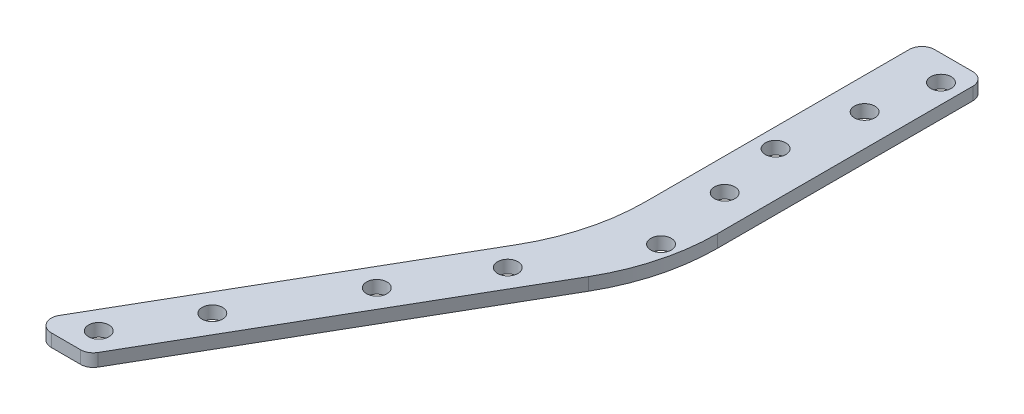
ISO-10303-21;
HEADER;
FILE_DESCRIPTION(('STEP AP214'),'2;1');
FILE_NAME('part.step','',(''),(''),'','','');
FILE_SCHEMA(('AUTOMOTIVE_DESIGN { 1 0 10303 214 1 1 1 1 }'));
ENDSEC;
DATA;
#1=APPLICATION_CONTEXT('core data for automotive mechanical design processes');
#2=APPLICATION_PROTOCOL_DEFINITION('international standard','automotive_design',2000,#1);
#3=PRODUCT_CONTEXT('',#1,'mechanical');
#4=PRODUCT('Part','Part','',(#3));
#5=PRODUCT_RELATED_PRODUCT_CATEGORY('part','',(#4));
#6=PRODUCT_DEFINITION_FORMATION('','',#4);
#7=PRODUCT_DEFINITION_CONTEXT('part definition',#1,'design');
#8=PRODUCT_DEFINITION('design','',#6,#7);
#9=PRODUCT_DEFINITION_SHAPE('','',#8);
#10=(LENGTH_UNIT() NAMED_UNIT(*) SI_UNIT(.MILLI.,.METRE.));
#11=(NAMED_UNIT(*) PLANE_ANGLE_UNIT() SI_UNIT($,.RADIAN.));
#12=(NAMED_UNIT(*) SI_UNIT($,.STERADIAN.) SOLID_ANGLE_UNIT());
#13=UNCERTAINTY_MEASURE_WITH_UNIT(LENGTH_MEASURE(1.E-05),#10,'distance_accuracy_value','');
#14=(GEOMETRIC_REPRESENTATION_CONTEXT(3) GLOBAL_UNCERTAINTY_ASSIGNED_CONTEXT((#13)) GLOBAL_UNIT_ASSIGNED_CONTEXT((#10,
#11,#12)) REPRESENTATION_CONTEXT('',''));
#15=CARTESIAN_POINT('',(0.,0.,0.));
#16=DIRECTION('',(0.,0.,1.));
#17=DIRECTION('',(1.,0.,0.));
#18=AXIS2_PLACEMENT_3D('',#15,#16,#17);
#19=CARTESIAN_POINT('',(0.,-3.175,0.));
#20=DIRECTION('',(0.,-1.,0.));
#21=DIRECTION('',(0.,0.,-1.));
#22=AXIS2_PLACEMENT_3D('',#19,#20,#21);
#23=PLANE('',#22);
#24=CARTESIAN_POINT('',(7.9375,-3.175,22.225));
#25=DIRECTION('',(0.,1.,0.));
#26=DIRECTION('',(0.,0.,1.));
#27=AXIS2_PLACEMENT_3D('',#24,#25,#26);
#28=CIRCLE('',#27,2.5527);
#29=CARTESIAN_POINT('',(7.9375,-3.175,24.7777));
#30=VERTEX_POINT('',#29);
#31=EDGE_CURVE('E437',#30,#30,#28,.T.);
#32=ORIENTED_EDGE('',*,*,#31,.T.);
#33=EDGE_LOOP('',(#32));
#34=FACE_BOUND('',#33,.T.);
#35=CARTESIAN_POINT('',(7.93750000000001,-3.175,57.15));
#36=DIRECTION('',(0.,1.,0.));
#37=DIRECTION('',(0.,0.,1.));
#38=AXIS2_PLACEMENT_3D('',#35,#36,#37);
#39=CIRCLE('',#38,2.5527);
#40=CARTESIAN_POINT('',(7.93750000000001,-3.175,59.7027));
#41=VERTEX_POINT('',#40);
#42=EDGE_CURVE('E429',#41,#41,#39,.T.);
#43=ORIENTED_EDGE('',*,*,#42,.T.);
#44=EDGE_LOOP('',(#43));
#45=FACE_BOUND('',#44,.T.);
#46=DIRECTION('',(0.,0.,-1.));
#47=VECTOR('',#46,1.);
#48=CARTESIAN_POINT('',(15.875,-3.175,0.));
#49=LINE('',#48,#47);
#50=CARTESIAN_POINT('',(15.875,-3.175,66.841874454343));
#51=VERTEX_POINT('',#50);
#52=CARTESIAN_POINT('',(15.875,-3.175,3.175));
#53=VERTEX_POINT('',#52);
#54=EDGE_CURVE('E223',#51,#53,#49,.T.);
#55=ORIENTED_EDGE('',*,*,#54,.F.);
#56=CARTESIAN_POINT('',(-34.925,-3.175,66.841874454343));
#57=DIRECTION('',(0.,-1.,0.));
#58=DIRECTION('',(0.,0.,-1.));
#59=AXIS2_PLACEMENT_3D('',#56,#57,#58);
#60=CIRCLE('',#59,50.8);
#61=CARTESIAN_POINT('',(9.06909051224946,-3.175,92.2418744543431));
#62=VERTEX_POINT('',#61);
#63=EDGE_CURVE('E202',#51,#62,#60,.T.);
#64=ORIENTED_EDGE('',*,*,#63,.T.);
#65=DIRECTION('',(0.500000000000001,0.,-0.866025403784438));
#66=VECTOR('',#65,1.);
#67=CARTESIAN_POINT('',(-36.6617420935413,-3.175,171.45));
#68=LINE('',#67,#66);
#69=CARTESIAN_POINT('',(-35.7451985412028,-3.175,169.8625));
#70=VERTEX_POINT('',#69);
#71=EDGE_CURVE('E267',#70,#62,#68,.T.);
#72=ORIENTED_EDGE('',*,*,#71,.F.);
#73=CARTESIAN_POINT('',(-38.4948291982184,-3.175,168.275));
#74=DIRECTION('',(0.,-1.,0.));
#75=DIRECTION('',(0.,0.,-1.));
#76=AXIS2_PLACEMENT_3D('',#73,#74,#75);
#77=CIRCLE('',#76,3.175);
#78=CARTESIAN_POINT('',(-38.4948291982184,-3.175,171.45));
#79=VERTEX_POINT('',#78);
#80=EDGE_CURVE('E175',#70,#79,#77,.T.);
#81=ORIENTED_EDGE('',*,*,#80,.T.);
#82=DIRECTION('',(1.,0.,0.));
#83=VECTOR('',#82,1.);
#84=CARTESIAN_POINT('',(-51.3264389309578,-3.175,171.45));
#85=LINE('',#84,#83);
#86=CARTESIAN_POINT('',(-45.8271776169266,-3.175,171.45));
#87=VERTEX_POINT('',#86);
#88=EDGE_CURVE('E159',#87,#79,#85,.T.);
#89=ORIENTED_EDGE('',*,*,#88,.F.);
#90=CARTESIAN_POINT('',(-45.8271776169266,-3.175,168.275));
#91=DIRECTION('',(0.,-1.,0.));
#92=DIRECTION('',(0.,0.,-1.));
#93=AXIS2_PLACEMENT_3D('',#90,#91,#92);
#94=CIRCLE('',#93,3.175);
#95=CARTESIAN_POINT('',(-48.5768082739422,-3.175,166.6875));
#96=VERTEX_POINT('',#95);
#97=EDGE_CURVE('E177',#87,#96,#94,.T.);
#98=ORIENTED_EDGE('',*,*,#97,.T.);
#99=DIRECTION('',(-0.500000000000001,0.,0.866025403784438));
#100=VECTOR('',#99,1.);
#101=CARTESIAN_POINT('',(0.,-3.175,82.55));
#102=LINE('',#101,#100);
#103=CARTESIAN_POINT('',(-6.80590948775052,-3.175,94.338181024499));
#104=VERTEX_POINT('',#103);
#105=EDGE_CURVE('E164',#104,#96,#102,.T.);
#106=ORIENTED_EDGE('',*,*,#105,.F.);
#107=CARTESIAN_POINT('',(-50.8,-3.175,68.9381810244989));
#108=DIRECTION('',(0.,-1.,0.));
#109=DIRECTION('',(0.,0.,-1.));
#110=AXIS2_PLACEMENT_3D('',#107,#108,#109);
#111=CIRCLE('',#110,50.8);
#112=CARTESIAN_POINT('',(0.,-3.175,68.9381810244989));
#113=VERTEX_POINT('',#112);
#114=EDGE_CURVE('E11',#104,#113,#111,.F.);
#115=ORIENTED_EDGE('',*,*,#114,.T.);
#116=DIRECTION('',(0.,0.,1.));
#117=VECTOR('',#116,1.);
#118=CARTESIAN_POINT('',(0.,-3.175,0.));
#119=LINE('',#118,#117);
#120=CARTESIAN_POINT('',(0.,-3.175,3.175));
#121=VERTEX_POINT('',#120);
#122=EDGE_CURVE('E218',#121,#113,#119,.T.);
#123=ORIENTED_EDGE('',*,*,#122,.F.);
#124=CARTESIAN_POINT('',(3.175,-3.175,3.175));
#125=DIRECTION('',(0.,-1.,0.));
#126=DIRECTION('',(0.,0.,-1.));
#127=AXIS2_PLACEMENT_3D('',#124,#125,#126);
#128=CIRCLE('',#127,3.175);
#129=CARTESIAN_POINT('',(3.175,-3.175,0.));
#130=VERTEX_POINT('',#129);
#131=EDGE_CURVE('E181',#121,#130,#128,.T.);
#132=ORIENTED_EDGE('',*,*,#131,.T.);
#133=DIRECTION('',(-1.,0.,0.));
#134=VECTOR('',#133,1.);
#135=CARTESIAN_POINT('',(0.,-3.175,0.));
#136=LINE('',#135,#134);
#137=CARTESIAN_POINT('',(12.7,-3.175,0.));
#138=VERTEX_POINT('',#137);
#139=EDGE_CURVE('E220',#138,#130,#136,.T.);
#140=ORIENTED_EDGE('',*,*,#139,.F.);
#141=CARTESIAN_POINT('',(12.7,-3.175,3.175));
#142=DIRECTION('',(0.,-1.,0.));
#143=DIRECTION('',(0.,0.,-1.));
#144=AXIS2_PLACEMENT_3D('',#141,#142,#143);
#145=CIRCLE('',#144,3.175);
#146=EDGE_CURVE('E158',#138,#53,#145,.T.);
#147=ORIENTED_EDGE('',*,*,#146,.T.);
#148=EDGE_LOOP('',(#55,#64,#72,#81,#89,#98,#106,#115,#123,#132,#140,#147));
#149=FACE_BOUND('',#148,.T.);
#150=CARTESIAN_POINT('',(-14.9279163028953,-3.175,121.105909487751));
#151=DIRECTION('',(0.,1.,0.));
#152=DIRECTION('',(0.,0.,1.));
#153=AXIS2_PLACEMENT_3D('',#150,#151,#152);
#154=CIRCLE('',#153,2.5527);
#155=CARTESIAN_POINT('',(-14.9279163028953,-3.175,123.658609487751));
#156=VERTEX_POINT('',#155);
#157=EDGE_CURVE('E264',#156,#156,#154,.T.);
#158=ORIENTED_EDGE('',*,*,#157,.T.);
#159=EDGE_LOOP('',(#158));
#160=FACE_BOUND('',#159,.T.);
#161=CARTESIAN_POINT('',(-40.3279163028954,-3.175,165.1));
#162=DIRECTION('',(0.,1.,0.));
#163=DIRECTION('',(0.,0.,1.));
#164=AXIS2_PLACEMENT_3D('',#161,#162,#163);
#165=CIRCLE('',#164,2.5527);
#166=CARTESIAN_POINT('',(-40.3279163028954,-3.175,167.6527));
#167=VERTEX_POINT('',#166);
#168=EDGE_CURVE('E258',#167,#167,#165,.T.);
#169=ORIENTED_EDGE('',*,*,#168,.T.);
#170=EDGE_LOOP('',(#169));
#171=FACE_BOUND('',#170,.T.);
#172=CARTESIAN_POINT('',(11.1125,-3.175,76.2));
#173=DIRECTION('',(0.,1.,0.));
#174=DIRECTION('',(0.,0.,1.));
#175=AXIS2_PLACEMENT_3D('',#172,#173,#174);
#176=CIRCLE('',#175,2.5527);
#177=CARTESIAN_POINT('',(11.1125,-3.175,78.7527));
#178=VERTEX_POINT('',#177);
#179=EDGE_CURVE('E252',#178,#178,#176,.T.);
#180=ORIENTED_EDGE('',*,*,#179,.T.);
#181=EDGE_LOOP('',(#180));
#182=FACE_BOUND('',#181,.T.);
#183=CARTESIAN_POINT('',(4.7625,-3.175,41.275));
#184=DIRECTION('',(0.,1.,0.));
#185=DIRECTION('',(0.,0.,1.));
#186=AXIS2_PLACEMENT_3D('',#183,#184,#185);
#187=CIRCLE('',#186,2.5527);
#188=CARTESIAN_POINT('',(4.7625,-3.175,43.8277));
#189=VERTEX_POINT('',#188);
#190=EDGE_CURVE('E246',#189,#189,#187,.T.);
#191=ORIENTED_EDGE('',*,*,#190,.T.);
#192=EDGE_LOOP('',(#191));
#193=FACE_BOUND('',#192,.T.);
#194=CARTESIAN_POINT('',(11.1125,-3.175,6.35));
#195=DIRECTION('',(0.,1.,0.));
#196=DIRECTION('',(0.,0.,1.));
#197=AXIS2_PLACEMENT_3D('',#194,#195,#196);
#198=CIRCLE('',#197,2.55269999999999);
#199=CARTESIAN_POINT('',(11.1125,-3.175,8.90269999999999));
#200=VERTEX_POINT('',#199);
#201=EDGE_CURVE('E229',#200,#200,#198,.T.);
#202=ORIENTED_EDGE('',*,*,#201,.T.);
#203=EDGE_LOOP('',(#202));
#204=FACE_BOUND('',#203,.T.);
#205=CARTESIAN_POINT('',(-29.9521776169266,-3.175,147.128693429844));
#206=DIRECTION('',(0.,1.,0.));
#207=DIRECTION('',(0.,0.,1.));
#208=AXIS2_PLACEMENT_3D('',#205,#206,#207);
#209=CIRCLE('',#208,2.5527);
#210=CARTESIAN_POINT('',(-29.9521776169266,-3.175,149.681393429844));
#211=VERTEX_POINT('',#210);
#212=EDGE_CURVE('E241',#211,#211,#209,.T.);
#213=ORIENTED_EDGE('',*,*,#212,.T.);
#214=EDGE_LOOP('',(#213));
#215=FACE_BOUND('',#214,.T.);
#216=CARTESIAN_POINT('',(-2.96467761692659,-3.175,100.384972260579));
#217=DIRECTION('',(0.,1.,0.));
#218=DIRECTION('',(0.,0.,1.));
#219=AXIS2_PLACEMENT_3D('',#216,#217,#218);
#220=CIRCLE('',#219,2.5527);
#221=CARTESIAN_POINT('',(-2.96467761692659,-3.175,102.937672260579));
#222=VERTEX_POINT('',#221);
#223=EDGE_CURVE('E423',#222,#222,#220,.T.);
#224=ORIENTED_EDGE('',*,*,#223,.T.);
#225=EDGE_LOOP('',(#224));
#226=FACE_BOUND('',#225,.T.);
#227=ADVANCED_FACE('F42',(#34,#45,#149,#160,#171,#182,#193,#204,#215,#226),#23,.T.);
#228=CARTESIAN_POINT('',(-36.6617420935413,-3.175,171.45));
#229=DIRECTION('',(0.866025403784438,0.,0.500000000000001));
#230=DIRECTION('',(0.500000000000001,0.,-0.866025403784438));
#231=AXIS2_PLACEMENT_3D('',#228,#229,#230);
#232=PLANE('',#231);
#233=ORIENTED_EDGE('',*,*,#71,.T.);
#234=DIRECTION('',(0.,1.,0.));
#235=VECTOR('',#234,1.);
#236=CARTESIAN_POINT('',(9.06909051224947,-3.175,92.2418744543431));
#237=LINE('',#236,#235);
#238=CARTESIAN_POINT('',(9.06909051224946,0.,92.2418744543431));
#239=VERTEX_POINT('',#238);
#240=EDGE_CURVE('E195',#62,#239,#237,.T.);
#241=ORIENTED_EDGE('',*,*,#240,.T.);
#242=DIRECTION('',(0.500000000000001,0.,-0.866025403784438));
#243=VECTOR('',#242,1.);
#244=CARTESIAN_POINT('',(-36.6617420935413,0.,171.45));
#245=LINE('',#244,#243);
#246=CARTESIAN_POINT('',(-35.7451985412028,0.,169.8625));
#247=VERTEX_POINT('',#246);
#248=EDGE_CURVE('E227',#247,#239,#245,.T.);
#249=ORIENTED_EDGE('',*,*,#248,.F.);
#250=DIRECTION('',(0.,1.,0.));
#251=VECTOR('',#250,1.);
#252=CARTESIAN_POINT('',(-35.7451985412028,-3.175,169.8625));
#253=LINE('',#252,#251);
#254=EDGE_CURVE('E193',#247,#70,#253,.F.);
#255=ORIENTED_EDGE('',*,*,#254,.T.);
#256=EDGE_LOOP('',(#233,#241,#249,#255));
#257=FACE_BOUND('',#256,.T.);
#258=ADVANCED_FACE('F292',(#257),#232,.T.);
#259=CARTESIAN_POINT('',(-51.3264389309578,-3.175,171.45));
#260=DIRECTION('',(0.,0.,1.));
#261=DIRECTION('',(1.,0.,0.));
#262=AXIS2_PLACEMENT_3D('',#259,#260,#261);
#263=PLANE('',#262);
#264=DIRECTION('',(1.,0.,0.));
#265=VECTOR('',#264,1.);
#266=CARTESIAN_POINT('',(-51.3264389309578,0.,171.45));
#267=LINE('',#266,#265);
#268=CARTESIAN_POINT('',(-45.8271776169266,0.,171.45));
#269=VERTEX_POINT('',#268);
#270=CARTESIAN_POINT('',(-38.4948291982184,0.,171.45));
#271=VERTEX_POINT('',#270);
#272=EDGE_CURVE('E167',#269,#271,#267,.T.);
#273=ORIENTED_EDGE('',*,*,#272,.F.);
#274=DIRECTION('',(0.,1.,0.));
#275=VECTOR('',#274,1.);
#276=CARTESIAN_POINT('',(-45.8271776169266,-3.175,171.45));
#277=LINE('',#276,#275);
#278=EDGE_CURVE('E191',#269,#87,#277,.F.);
#279=ORIENTED_EDGE('',*,*,#278,.T.);
#280=ORIENTED_EDGE('',*,*,#88,.T.);
#281=DIRECTION('',(0.,1.,0.));
#282=VECTOR('',#281,1.);
#283=CARTESIAN_POINT('',(-38.4948291982184,-3.175,171.45));
#284=LINE('',#283,#282);
#285=EDGE_CURVE('E188',#79,#271,#284,.T.);
#286=ORIENTED_EDGE('',*,*,#285,.T.);
#287=EDGE_LOOP('',(#273,#279,#280,#286));
#288=FACE_BOUND('',#287,.T.);
#289=ADVANCED_FACE('F300',(#288),#263,.T.);
#290=CARTESIAN_POINT('',(0.,-3.175,82.55));
#291=DIRECTION('',(-0.866025403784438,0.,-0.500000000000001));
#292=DIRECTION('',(-0.500000000000001,0.,0.866025403784438));
#293=AXIS2_PLACEMENT_3D('',#290,#291,#292);
#294=PLANE('',#293);
#295=DIRECTION('',(-0.500000000000001,0.,0.866025403784438));
#296=VECTOR('',#295,1.);
#297=CARTESIAN_POINT('',(0.,0.,82.55));
#298=LINE('',#297,#296);
#299=CARTESIAN_POINT('',(-6.80590948775052,0.,94.338181024499));
#300=VERTEX_POINT('',#299);
#301=CARTESIAN_POINT('',(-48.5768082739422,0.,166.6875));
#302=VERTEX_POINT('',#301);
#303=EDGE_CURVE('E208',#300,#302,#298,.T.);
#304=ORIENTED_EDGE('',*,*,#303,.F.);
#305=DIRECTION('',(0.,1.,0.));
#306=VECTOR('',#305,1.);
#307=CARTESIAN_POINT('',(-6.80590948775052,-3.175,94.338181024499));
#308=LINE('',#307,#306);
#309=EDGE_CURVE('E57',#300,#104,#308,.F.);
#310=ORIENTED_EDGE('',*,*,#309,.T.);
#311=ORIENTED_EDGE('',*,*,#105,.T.);
#312=DIRECTION('',(0.,1.,0.));
#313=VECTOR('',#312,1.);
#314=CARTESIAN_POINT('',(-48.5768082739422,-3.175,166.6875));
#315=LINE('',#314,#313);
#316=EDGE_CURVE('E185',#96,#302,#315,.T.);
#317=ORIENTED_EDGE('',*,*,#316,.T.);
#318=EDGE_LOOP('',(#304,#310,#311,#317));
#319=FACE_BOUND('',#318,.T.);
#320=ADVANCED_FACE('F213',(#319),#294,.T.);
#321=CARTESIAN_POINT('',(0.,-3.175,0.));
#322=DIRECTION('',(-1.,0.,0.));
#323=DIRECTION('',(0.,0.,1.));
#324=AXIS2_PLACEMENT_3D('',#321,#322,#323);
#325=PLANE('',#324);
#326=ORIENTED_EDGE('',*,*,#122,.T.);
#327=DIRECTION('',(0.,1.,0.));
#328=VECTOR('',#327,1.);
#329=CARTESIAN_POINT('',(0.,0.,68.9381810244989));
#330=LINE('',#329,#328);
#331=CARTESIAN_POINT('',(0.,0.,68.9381810244989));
#332=VERTEX_POINT('',#331);
#333=EDGE_CURVE('E204',#113,#332,#330,.T.);
#334=ORIENTED_EDGE('',*,*,#333,.T.);
#335=DIRECTION('',(0.,0.,1.));
#336=VECTOR('',#335,1.);
#337=CARTESIAN_POINT('',(0.,0.,0.));
#338=LINE('',#337,#336);
#339=CARTESIAN_POINT('',(0.,0.,3.175));
#340=VERTEX_POINT('',#339);
#341=EDGE_CURVE('E153',#340,#332,#338,.T.);
#342=ORIENTED_EDGE('',*,*,#341,.F.);
#343=DIRECTION('',(0.,1.,0.));
#344=VECTOR('',#343,1.);
#345=CARTESIAN_POINT('',(0.,-3.175,3.175));
#346=LINE('',#345,#344);
#347=EDGE_CURVE('E173',#340,#121,#346,.F.);
#348=ORIENTED_EDGE('',*,*,#347,.T.);
#349=EDGE_LOOP('',(#326,#334,#342,#348));
#350=FACE_BOUND('',#349,.T.);
#351=ADVANCED_FACE('F216',(#350),#325,.T.);
#352=CARTESIAN_POINT('',(0.,-3.175,0.));
#353=DIRECTION('',(0.,0.,-1.));
#354=DIRECTION('',(-1.,0.,0.));
#355=AXIS2_PLACEMENT_3D('',#352,#353,#354);
#356=PLANE('',#355);
#357=ORIENTED_EDGE('',*,*,#139,.T.);
#358=DIRECTION('',(0.,1.,0.));
#359=VECTOR('',#358,1.);
#360=CARTESIAN_POINT('',(3.175,-3.175,0.));
#361=LINE('',#360,#359);
#362=CARTESIAN_POINT('',(3.175,0.,0.));
#363=VERTEX_POINT('',#362);
#364=EDGE_CURVE('E152',#130,#363,#361,.T.);
#365=ORIENTED_EDGE('',*,*,#364,.T.);
#366=DIRECTION('',(-1.,0.,0.));
#367=VECTOR('',#366,1.);
#368=CARTESIAN_POINT('',(0.,0.,0.));
#369=LINE('',#368,#367);
#370=CARTESIAN_POINT('',(12.7,0.,0.));
#371=VERTEX_POINT('',#370);
#372=EDGE_CURVE('E135',#371,#363,#369,.T.);
#373=ORIENTED_EDGE('',*,*,#372,.F.);
#374=DIRECTION('',(0.,1.,0.));
#375=VECTOR('',#374,1.);
#376=CARTESIAN_POINT('',(12.7,-3.175,0.));
#377=LINE('',#376,#375);
#378=EDGE_CURVE('E149',#371,#138,#377,.F.);
#379=ORIENTED_EDGE('',*,*,#378,.T.);
#380=EDGE_LOOP('',(#357,#365,#373,#379));
#381=FACE_BOUND('',#380,.T.);
#382=ADVANCED_FACE('F148',(#381),#356,.T.);
#383=CARTESIAN_POINT('',(15.875,-3.175,0.));
#384=DIRECTION('',(1.,0.,0.));
#385=DIRECTION('',(0.,0.,-1.));
#386=AXIS2_PLACEMENT_3D('',#383,#384,#385);
#387=PLANE('',#386);
#388=DIRECTION('',(0.,0.,-1.));
#389=VECTOR('',#388,1.);
#390=CARTESIAN_POINT('',(15.875,0.,0.));
#391=LINE('',#390,#389);
#392=CARTESIAN_POINT('',(15.875,0.,66.841874454343));
#393=VERTEX_POINT('',#392);
#394=CARTESIAN_POINT('',(15.875,0.,3.175));
#395=VERTEX_POINT('',#394);
#396=EDGE_CURVE('E137',#393,#395,#391,.T.);
#397=ORIENTED_EDGE('',*,*,#396,.F.);
#398=DIRECTION('',(0.,1.,0.));
#399=VECTOR('',#398,1.);
#400=CARTESIAN_POINT('',(15.875,-3.175,66.841874454343));
#401=LINE('',#400,#399);
#402=EDGE_CURVE('E200',#393,#51,#401,.F.);
#403=ORIENTED_EDGE('',*,*,#402,.T.);
#404=ORIENTED_EDGE('',*,*,#54,.T.);
#405=DIRECTION('',(0.,1.,0.));
#406=VECTOR('',#405,1.);
#407=CARTESIAN_POINT('',(15.875,-3.175,3.175));
#408=LINE('',#407,#406);
#409=EDGE_CURVE('E183',#53,#395,#408,.T.);
#410=ORIENTED_EDGE('',*,*,#409,.T.);
#411=EDGE_LOOP('',(#397,#403,#404,#410));
#412=FACE_BOUND('',#411,.T.);
#413=ADVANCED_FACE('F271',(#412),#387,.T.);
#414=CARTESIAN_POINT('',(0.,0.,0.));
#415=DIRECTION('',(0.,-1.,0.));
#416=DIRECTION('',(0.,0.,-1.));
#417=AXIS2_PLACEMENT_3D('',#414,#415,#416);
#418=PLANE('',#417);
#419=CARTESIAN_POINT('',(7.9375,0.,22.225));
#420=DIRECTION('',(0.,1.,0.));
#421=DIRECTION('',(0.,0.,1.));
#422=AXIS2_PLACEMENT_3D('',#419,#420,#421);
#423=CIRCLE('',#422,2.55269999999999);
#424=CARTESIAN_POINT('',(7.9375,0.,24.7777));
#425=VERTEX_POINT('',#424);
#426=EDGE_CURVE('E439',#425,#425,#423,.T.);
#427=ORIENTED_EDGE('',*,*,#426,.F.);
#428=EDGE_LOOP('',(#427));
#429=FACE_BOUND('',#428,.T.);
#430=CARTESIAN_POINT('',(7.93750000000001,0.,57.15));
#431=DIRECTION('',(0.,1.,0.));
#432=DIRECTION('',(0.,0.,1.));
#433=AXIS2_PLACEMENT_3D('',#430,#431,#432);
#434=CIRCLE('',#433,2.55269999999999);
#435=CARTESIAN_POINT('',(7.93750000000001,0.,59.7027));
#436=VERTEX_POINT('',#435);
#437=EDGE_CURVE('E434',#436,#436,#434,.T.);
#438=ORIENTED_EDGE('',*,*,#437,.F.);
#439=EDGE_LOOP('',(#438));
#440=FACE_BOUND('',#439,.T.);
#441=CARTESIAN_POINT('',(-2.96467761692659,0.,100.384972260579));
#442=DIRECTION('',(0.,1.,0.));
#443=DIRECTION('',(0.,0.,1.));
#444=AXIS2_PLACEMENT_3D('',#441,#442,#443);
#445=CIRCLE('',#444,2.55269999999999);
#446=CARTESIAN_POINT('',(-2.96467761692659,0.,102.937672260579));
#447=VERTEX_POINT('',#446);
#448=EDGE_CURVE('E425',#447,#447,#445,.T.);
#449=ORIENTED_EDGE('',*,*,#448,.F.);
#450=EDGE_LOOP('',(#449));
#451=FACE_BOUND('',#450,.T.);
#452=CARTESIAN_POINT('',(-29.9521776169266,0.,147.128693429844));
#453=DIRECTION('',(0.,1.,0.));
#454=DIRECTION('',(0.,0.,1.));
#455=AXIS2_PLACEMENT_3D('',#452,#453,#454);
#456=CIRCLE('',#455,2.55269999999999);
#457=CARTESIAN_POINT('',(-29.9521776169266,0.,149.681393429844));
#458=VERTEX_POINT('',#457);
#459=EDGE_CURVE('E424',#458,#458,#456,.T.);
#460=ORIENTED_EDGE('',*,*,#459,.F.);
#461=EDGE_LOOP('',(#460));
#462=FACE_BOUND('',#461,.T.);
#463=CARTESIAN_POINT('',(11.1125,0.,6.35));
#464=DIRECTION('',(0.,1.,0.));
#465=DIRECTION('',(0.,0.,1.));
#466=AXIS2_PLACEMENT_3D('',#463,#464,#465);
#467=CIRCLE('',#466,2.55269999999999);
#468=CARTESIAN_POINT('',(11.1125,0.,8.90269999999999));
#469=VERTEX_POINT('',#468);
#470=EDGE_CURVE('E233',#469,#469,#467,.T.);
#471=ORIENTED_EDGE('',*,*,#470,.F.);
#472=EDGE_LOOP('',(#471));
#473=FACE_BOUND('',#472,.T.);
#474=CARTESIAN_POINT('',(4.7625,0.,41.275));
#475=DIRECTION('',(0.,1.,0.));
#476=DIRECTION('',(0.,0.,1.));
#477=AXIS2_PLACEMENT_3D('',#474,#475,#476);
#478=CIRCLE('',#477,2.5527);
#479=CARTESIAN_POINT('',(4.7625,0.,43.8277));
#480=VERTEX_POINT('',#479);
#481=EDGE_CURVE('E238',#480,#480,#478,.T.);
#482=ORIENTED_EDGE('',*,*,#481,.F.);
#483=EDGE_LOOP('',(#482));
#484=FACE_BOUND('',#483,.T.);
#485=CARTESIAN_POINT('',(11.1125,0.,76.2));
#486=DIRECTION('',(0.,1.,0.));
#487=DIRECTION('',(0.,0.,1.));
#488=AXIS2_PLACEMENT_3D('',#485,#486,#487);
#489=CIRCLE('',#488,2.5527);
#490=CARTESIAN_POINT('',(11.1125,0.,78.7527));
#491=VERTEX_POINT('',#490);
#492=EDGE_CURVE('E249',#491,#491,#489,.T.);
#493=ORIENTED_EDGE('',*,*,#492,.F.);
#494=EDGE_LOOP('',(#493));
#495=FACE_BOUND('',#494,.T.);
#496=CARTESIAN_POINT('',(-40.3279163028954,0.,165.1));
#497=DIRECTION('',(0.,1.,0.));
#498=DIRECTION('',(0.,0.,1.));
#499=AXIS2_PLACEMENT_3D('',#496,#497,#498);
#500=CIRCLE('',#499,2.5527);
#501=CARTESIAN_POINT('',(-40.3279163028954,0.,167.6527));
#502=VERTEX_POINT('',#501);
#503=EDGE_CURVE('E255',#502,#502,#500,.T.);
#504=ORIENTED_EDGE('',*,*,#503,.F.);
#505=EDGE_LOOP('',(#504));
#506=FACE_BOUND('',#505,.T.);
#507=CARTESIAN_POINT('',(-14.9279163028953,0.,121.105909487751));
#508=DIRECTION('',(0.,1.,0.));
#509=DIRECTION('',(0.,0.,1.));
#510=AXIS2_PLACEMENT_3D('',#507,#508,#509);
#511=CIRCLE('',#510,2.5527);
#512=CARTESIAN_POINT('',(-14.9279163028953,0.,123.658609487751));
#513=VERTEX_POINT('',#512);
#514=EDGE_CURVE('E261',#513,#513,#511,.T.);
#515=ORIENTED_EDGE('',*,*,#514,.F.);
#516=EDGE_LOOP('',(#515));
#517=FACE_BOUND('',#516,.T.);
#518=ORIENTED_EDGE('',*,*,#248,.T.);
#519=CARTESIAN_POINT('',(-34.925,0.,66.841874454343));
#520=DIRECTION('',(0.,-1.,0.));
#521=DIRECTION('',(0.,0.,-1.));
#522=AXIS2_PLACEMENT_3D('',#519,#520,#521);
#523=CIRCLE('',#522,50.8);
#524=EDGE_CURVE('E198',#239,#393,#523,.F.);
#525=ORIENTED_EDGE('',*,*,#524,.T.);
#526=ORIENTED_EDGE('',*,*,#396,.T.);
#527=CARTESIAN_POINT('',(12.7,0.,3.175));
#528=DIRECTION('',(0.,-1.,0.));
#529=DIRECTION('',(0.,0.,-1.));
#530=AXIS2_PLACEMENT_3D('',#527,#528,#529);
#531=CIRCLE('',#530,3.175);
#532=EDGE_CURVE('E131',#395,#371,#531,.F.);
#533=ORIENTED_EDGE('',*,*,#532,.T.);
#534=ORIENTED_EDGE('',*,*,#372,.T.);
#535=CARTESIAN_POINT('',(3.175,0.,3.175));
#536=DIRECTION('',(0.,-1.,0.));
#537=DIRECTION('',(0.,0.,-1.));
#538=AXIS2_PLACEMENT_3D('',#535,#536,#537);
#539=CIRCLE('',#538,3.175);
#540=EDGE_CURVE('E142',#363,#340,#539,.F.);
#541=ORIENTED_EDGE('',*,*,#540,.T.);
#542=ORIENTED_EDGE('',*,*,#341,.T.);
#543=CARTESIAN_POINT('',(-50.8,0.,68.9381810244989));
#544=DIRECTION('',(0.,-1.,0.));
#545=DIRECTION('',(0.,0.,-1.));
#546=AXIS2_PLACEMENT_3D('',#543,#544,#545);
#547=CIRCLE('',#546,50.8);
#548=EDGE_CURVE('E50',#332,#300,#547,.T.);
#549=ORIENTED_EDGE('',*,*,#548,.T.);
#550=ORIENTED_EDGE('',*,*,#303,.T.);
#551=CARTESIAN_POINT('',(-45.8271776169266,0.,168.275));
#552=DIRECTION('',(0.,-1.,0.));
#553=DIRECTION('',(0.,0.,-1.));
#554=AXIS2_PLACEMENT_3D('',#551,#552,#553);
#555=CIRCLE('',#554,3.175);
#556=EDGE_CURVE('E143',#302,#269,#555,.F.);
#557=ORIENTED_EDGE('',*,*,#556,.T.);
#558=ORIENTED_EDGE('',*,*,#272,.T.);
#559=CARTESIAN_POINT('',(-38.4948291982184,0.,168.275));
#560=DIRECTION('',(0.,-1.,0.));
#561=DIRECTION('',(0.,0.,-1.));
#562=AXIS2_PLACEMENT_3D('',#559,#560,#561);
#563=CIRCLE('',#562,3.175);
#564=EDGE_CURVE('E161',#271,#247,#563,.F.);
#565=ORIENTED_EDGE('',*,*,#564,.T.);
#566=EDGE_LOOP('',(#518,#525,#526,#533,#534,#541,#542,#549,#550,#557,#558,#565));
#567=FACE_BOUND('',#566,.T.);
#568=ADVANCED_FACE('F134',(#429,#440,#451,#462,#473,#484,#495,#506,#517,#567),#418,.F.);
#569=CARTESIAN_POINT('',(-14.9279163028953,-3.175,121.105909487751));
#570=DIRECTION('',(0.,1.,0.));
#571=DIRECTION('',(0.,0.,1.));
#572=AXIS2_PLACEMENT_3D('',#569,#570,#571);
#573=CYLINDRICAL_SURFACE('',#572,2.5527);
#574=ORIENTED_EDGE('',*,*,#157,.F.);
#575=EDGE_LOOP('',(#574));
#576=FACE_BOUND('',#575,.T.);
#577=ORIENTED_EDGE('',*,*,#514,.T.);
#578=EDGE_LOOP('',(#577));
#579=FACE_BOUND('',#578,.T.);
#580=ADVANCED_FACE('F306',(#576,#579),#573,.F.);
#581=CARTESIAN_POINT('',(-40.3279163028954,-3.175,165.1));
#582=DIRECTION('',(0.,1.,0.));
#583=DIRECTION('',(0.,0.,1.));
#584=AXIS2_PLACEMENT_3D('',#581,#582,#583);
#585=CYLINDRICAL_SURFACE('',#584,2.5527);
#586=ORIENTED_EDGE('',*,*,#168,.F.);
#587=EDGE_LOOP('',(#586));
#588=FACE_BOUND('',#587,.T.);
#589=ORIENTED_EDGE('',*,*,#503,.T.);
#590=EDGE_LOOP('',(#589));
#591=FACE_BOUND('',#590,.T.);
#592=ADVANCED_FACE('F397',(#588,#591),#585,.F.);
#593=CARTESIAN_POINT('',(11.1125,-3.175,76.2));
#594=DIRECTION('',(0.,1.,0.));
#595=DIRECTION('',(0.,0.,1.));
#596=AXIS2_PLACEMENT_3D('',#593,#594,#595);
#597=CYLINDRICAL_SURFACE('',#596,2.5527);
#598=ORIENTED_EDGE('',*,*,#179,.F.);
#599=EDGE_LOOP('',(#598));
#600=FACE_BOUND('',#599,.T.);
#601=ORIENTED_EDGE('',*,*,#492,.T.);
#602=EDGE_LOOP('',(#601));
#603=FACE_BOUND('',#602,.T.);
#604=ADVANCED_FACE('F394',(#600,#603),#597,.F.);
#605=CARTESIAN_POINT('',(4.7625,-3.175,41.275));
#606=DIRECTION('',(0.,1.,0.));
#607=DIRECTION('',(0.,0.,1.));
#608=AXIS2_PLACEMENT_3D('',#605,#606,#607);
#609=CYLINDRICAL_SURFACE('',#608,2.5527);
#610=ORIENTED_EDGE('',*,*,#190,.F.);
#611=EDGE_LOOP('',(#610));
#612=FACE_BOUND('',#611,.T.);
#613=ORIENTED_EDGE('',*,*,#481,.T.);
#614=EDGE_LOOP('',(#613));
#615=FACE_BOUND('',#614,.T.);
#616=ADVANCED_FACE('F287',(#612,#615),#609,.F.);
#617=CARTESIAN_POINT('',(11.1125,-3.175,6.35));
#618=DIRECTION('',(0.,1.,0.));
#619=DIRECTION('',(0.,0.,1.));
#620=AXIS2_PLACEMENT_3D('',#617,#618,#619);
#621=CYLINDRICAL_SURFACE('',#620,2.55269999999999);
#622=ORIENTED_EDGE('',*,*,#201,.F.);
#623=EDGE_LOOP('',(#622));
#624=FACE_BOUND('',#623,.T.);
#625=ORIENTED_EDGE('',*,*,#470,.T.);
#626=EDGE_LOOP('',(#625));
#627=FACE_BOUND('',#626,.T.);
#628=ADVANCED_FACE('F278',(#624,#627),#621,.F.);
#629=CARTESIAN_POINT('',(3.175,-3.175,3.175));
#630=DIRECTION('',(0.,1.,0.));
#631=DIRECTION('',(0.,0.,1.));
#632=AXIS2_PLACEMENT_3D('',#629,#630,#631);
#633=CYLINDRICAL_SURFACE('',#632,3.175);
#634=ORIENTED_EDGE('',*,*,#131,.F.);
#635=ORIENTED_EDGE('',*,*,#347,.F.);
#636=ORIENTED_EDGE('',*,*,#540,.F.);
#637=ORIENTED_EDGE('',*,*,#364,.F.);
#638=EDGE_LOOP('',(#634,#635,#636,#637));
#639=FACE_BOUND('',#638,.T.);
#640=ADVANCED_FACE('F276',(#639),#633,.T.);
#641=CARTESIAN_POINT('',(12.7,-3.175,3.175));
#642=DIRECTION('',(0.,1.,0.));
#643=DIRECTION('',(0.,0.,1.));
#644=AXIS2_PLACEMENT_3D('',#641,#642,#643);
#645=CYLINDRICAL_SURFACE('',#644,3.175);
#646=ORIENTED_EDGE('',*,*,#146,.F.);
#647=ORIENTED_EDGE('',*,*,#378,.F.);
#648=ORIENTED_EDGE('',*,*,#532,.F.);
#649=ORIENTED_EDGE('',*,*,#409,.F.);
#650=EDGE_LOOP('',(#646,#647,#648,#649));
#651=FACE_BOUND('',#650,.T.);
#652=ADVANCED_FACE('F156',(#651),#645,.T.);
#653=CARTESIAN_POINT('',(-45.8271776169266,-3.175,168.275));
#654=DIRECTION('',(0.,1.,0.));
#655=DIRECTION('',(0.,0.,1.));
#656=AXIS2_PLACEMENT_3D('',#653,#654,#655);
#657=CYLINDRICAL_SURFACE('',#656,3.175);
#658=ORIENTED_EDGE('',*,*,#97,.F.);
#659=ORIENTED_EDGE('',*,*,#278,.F.);
#660=ORIENTED_EDGE('',*,*,#556,.F.);
#661=ORIENTED_EDGE('',*,*,#316,.F.);
#662=EDGE_LOOP('',(#658,#659,#660,#661));
#663=FACE_BOUND('',#662,.T.);
#664=ADVANCED_FACE('F284',(#663),#657,.T.);
#665=CARTESIAN_POINT('',(-38.4948291982184,-3.175,168.275));
#666=DIRECTION('',(0.,1.,0.));
#667=DIRECTION('',(0.,0.,1.));
#668=AXIS2_PLACEMENT_3D('',#665,#666,#667);
#669=CYLINDRICAL_SURFACE('',#668,3.175);
#670=ORIENTED_EDGE('',*,*,#80,.F.);
#671=ORIENTED_EDGE('',*,*,#254,.F.);
#672=ORIENTED_EDGE('',*,*,#564,.F.);
#673=ORIENTED_EDGE('',*,*,#285,.F.);
#674=EDGE_LOOP('',(#670,#671,#672,#673));
#675=FACE_BOUND('',#674,.T.);
#676=ADVANCED_FACE('F332',(#675),#669,.T.);
#677=CARTESIAN_POINT('',(-34.925,-3.175,66.841874454343));
#678=DIRECTION('',(0.,1.,0.));
#679=DIRECTION('',(0.,0.,1.));
#680=AXIS2_PLACEMENT_3D('',#677,#678,#679);
#681=CYLINDRICAL_SURFACE('',#680,50.8);
#682=ORIENTED_EDGE('',*,*,#63,.F.);
#683=ORIENTED_EDGE('',*,*,#402,.F.);
#684=ORIENTED_EDGE('',*,*,#524,.F.);
#685=ORIENTED_EDGE('',*,*,#240,.F.);
#686=EDGE_LOOP('',(#682,#683,#684,#685));
#687=FACE_BOUND('',#686,.T.);
#688=ADVANCED_FACE('F329',(#687),#681,.T.);
#689=CARTESIAN_POINT('',(-50.8,-3.175,68.9381810244989));
#690=DIRECTION('',(0.,-1.,0.));
#691=DIRECTION('',(0.,0.,-1.));
#692=AXIS2_PLACEMENT_3D('',#689,#690,#691);
#693=CYLINDRICAL_SURFACE('',#692,50.8);
#694=ORIENTED_EDGE('',*,*,#114,.F.);
#695=ORIENTED_EDGE('',*,*,#309,.F.);
#696=ORIENTED_EDGE('',*,*,#548,.F.);
#697=ORIENTED_EDGE('',*,*,#333,.F.);
#698=EDGE_LOOP('',(#694,#695,#696,#697));
#699=FACE_BOUND('',#698,.T.);
#700=ADVANCED_FACE('F44',(#699),#693,.F.);
#701=CARTESIAN_POINT('',(-29.9521776169266,0.,147.128693429844));
#702=DIRECTION('',(0.,1.,0.));
#703=DIRECTION('',(0.,0.,1.));
#704=AXIS2_PLACEMENT_3D('',#701,#702,#703);
#705=CYLINDRICAL_SURFACE('',#704,2.55269999999999);
#706=ORIENTED_EDGE('',*,*,#212,.F.);
#707=EDGE_LOOP('',(#706));
#708=FACE_BOUND('',#707,.T.);
#709=ORIENTED_EDGE('',*,*,#459,.T.);
#710=EDGE_LOOP('',(#709));
#711=FACE_BOUND('',#710,.T.);
#712=ADVANCED_FACE('F340',(#708,#711),#705,.F.);
#713=CARTESIAN_POINT('',(-2.96467761692659,0.,100.384972260579));
#714=DIRECTION('',(0.,1.,0.));
#715=DIRECTION('',(0.,0.,1.));
#716=AXIS2_PLACEMENT_3D('',#713,#714,#715);
#717=CYLINDRICAL_SURFACE('',#716,2.55269999999999);
#718=ORIENTED_EDGE('',*,*,#223,.F.);
#719=EDGE_LOOP('',(#718));
#720=FACE_BOUND('',#719,.T.);
#721=ORIENTED_EDGE('',*,*,#448,.T.);
#722=EDGE_LOOP('',(#721));
#723=FACE_BOUND('',#722,.T.);
#724=ADVANCED_FACE('F356',(#720,#723),#717,.F.);
#725=CARTESIAN_POINT('',(7.93750000000001,0.,57.15));
#726=DIRECTION('',(0.,1.,0.));
#727=DIRECTION('',(0.,0.,1.));
#728=AXIS2_PLACEMENT_3D('',#725,#726,#727);
#729=CYLINDRICAL_SURFACE('',#728,2.55269999999999);
#730=ORIENTED_EDGE('',*,*,#42,.F.);
#731=EDGE_LOOP('',(#730));
#732=FACE_BOUND('',#731,.T.);
#733=ORIENTED_EDGE('',*,*,#437,.T.);
#734=EDGE_LOOP('',(#733));
#735=FACE_BOUND('',#734,.T.);
#736=ADVANCED_FACE('F366',(#732,#735),#729,.F.);
#737=CARTESIAN_POINT('',(7.9375,0.,22.225));
#738=DIRECTION('',(0.,1.,0.));
#739=DIRECTION('',(0.,0.,1.));
#740=AXIS2_PLACEMENT_3D('',#737,#738,#739);
#741=CYLINDRICAL_SURFACE('',#740,2.55269999999999);
#742=ORIENTED_EDGE('',*,*,#31,.F.);
#743=EDGE_LOOP('',(#742));
#744=FACE_BOUND('',#743,.T.);
#745=ORIENTED_EDGE('',*,*,#426,.T.);
#746=EDGE_LOOP('',(#745));
#747=FACE_BOUND('',#746,.T.);
#748=ADVANCED_FACE('F376',(#744,#747),#741,.F.);
#749=CLOSED_SHELL('',(#227,#258,#289,#320,#351,#382,#413,#568,#580,#592,#604,#616,#628,#640,
#652,#664,#676,#688,#700,#712,#724,#736,#748));
#750=MANIFOLD_SOLID_BREP('B2',#749);
#751=ADVANCED_BREP_SHAPE_REPRESENTATION('',(#18,#750),#14);
#752=SHAPE_DEFINITION_REPRESENTATION(#9,#751);
ENDSEC;
END-ISO-10303-21;
